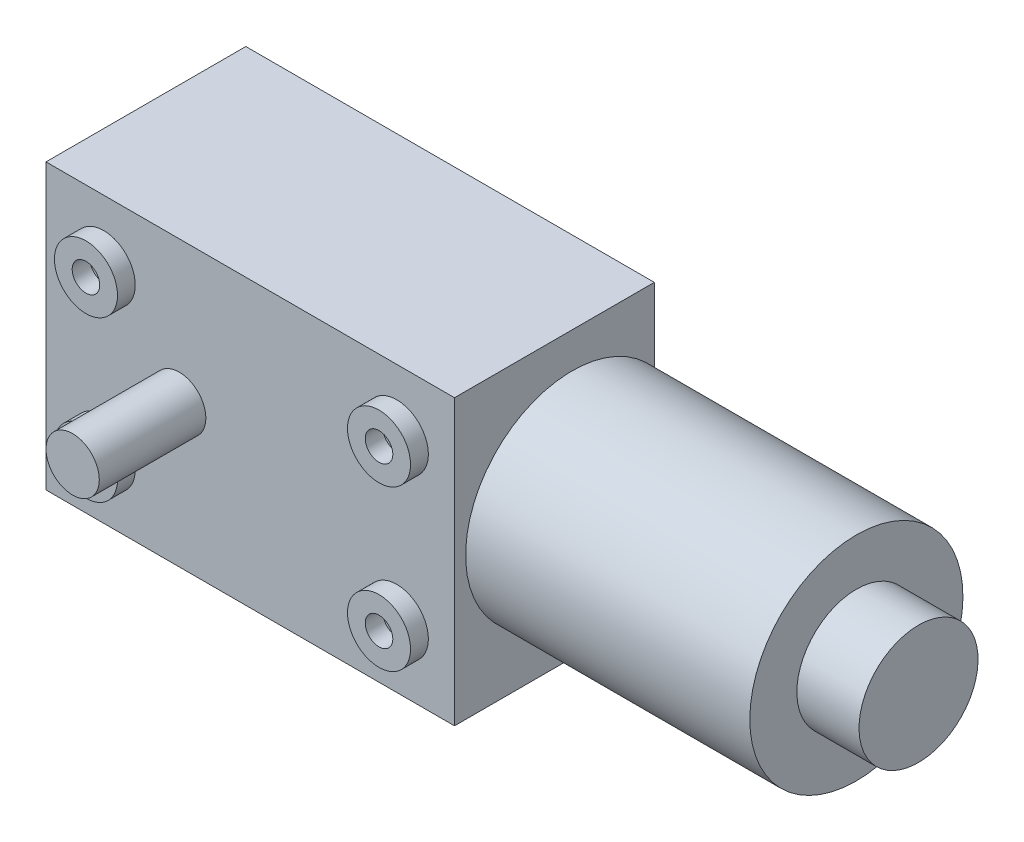
ISO-10303-21;
HEADER;
FILE_DESCRIPTION(('STEP AP214'),'2;1');
FILE_NAME('part.step','',(''),(''),'','','');
FILE_SCHEMA(('AUTOMOTIVE_DESIGN { 1 0 10303 214 1 1 1 1 }'));
ENDSEC;
DATA;
#1=APPLICATION_CONTEXT('core data for automotive mechanical design processes');
#2=APPLICATION_PROTOCOL_DEFINITION('international standard','automotive_design',2000,#1);
#3=PRODUCT_CONTEXT('',#1,'mechanical');
#4=PRODUCT('Part','Part','',(#3));
#5=PRODUCT_RELATED_PRODUCT_CATEGORY('part','',(#4));
#6=PRODUCT_DEFINITION_FORMATION('','',#4);
#7=PRODUCT_DEFINITION_CONTEXT('part definition',#1,'design');
#8=PRODUCT_DEFINITION('design','',#6,#7);
#9=PRODUCT_DEFINITION_SHAPE('','',#8);
#10=(LENGTH_UNIT() NAMED_UNIT(*) SI_UNIT(.MILLI.,.METRE.));
#11=(NAMED_UNIT(*) PLANE_ANGLE_UNIT() SI_UNIT($,.RADIAN.));
#12=(NAMED_UNIT(*) SI_UNIT($,.STERADIAN.) SOLID_ANGLE_UNIT());
#13=UNCERTAINTY_MEASURE_WITH_UNIT(LENGTH_MEASURE(1.E-05),#10,'distance_accuracy_value','');
#14=(GEOMETRIC_REPRESENTATION_CONTEXT(3) GLOBAL_UNCERTAINTY_ASSIGNED_CONTEXT((#13)) GLOBAL_UNIT_ASSIGNED_CONTEXT((#10,
#11,#12)) REPRESENTATION_CONTEXT('',''));
#15=CARTESIAN_POINT('',(0.,0.,0.));
#16=DIRECTION('',(0.,0.,1.));
#17=DIRECTION('',(1.,0.,0.));
#18=AXIS2_PLACEMENT_3D('',#15,#16,#17);
#19=CARTESIAN_POINT('',(-23.,16.,22.5));
#20=DIRECTION('',(1.,0.,0.));
#21=DIRECTION('',(0.,1.,0.));
#22=AXIS2_PLACEMENT_3D('',#19,#20,#21);
#23=PLANE('',#22);
#24=DIRECTION('',(0.,-1.,0.));
#25=VECTOR('',#24,1.);
#26=CARTESIAN_POINT('',(-23.,16.,0.));
#27=LINE('',#26,#25);
#28=CARTESIAN_POINT('',(-23.,16.,0.));
#29=VERTEX_POINT('',#28);
#30=CARTESIAN_POINT('',(-23.,-16.,0.));
#31=VERTEX_POINT('',#30);
#32=EDGE_CURVE('E157',#29,#31,#27,.T.);
#33=ORIENTED_EDGE('',*,*,#32,.T.);
#34=DIRECTION('',(0.,0.,-1.));
#35=VECTOR('',#34,1.);
#36=CARTESIAN_POINT('',(-23.,-16.,22.5));
#37=LINE('',#36,#35);
#38=CARTESIAN_POINT('',(-23.,-16.,22.5));
#39=VERTEX_POINT('',#38);
#40=EDGE_CURVE('E176',#39,#31,#37,.T.);
#41=ORIENTED_EDGE('',*,*,#40,.F.);
#42=DIRECTION('',(0.,-1.,0.));
#43=VECTOR('',#42,1.);
#44=CARTESIAN_POINT('',(-23.,16.,22.5));
#45=LINE('',#44,#43);
#46=CARTESIAN_POINT('',(-23.,16.,22.5));
#47=VERTEX_POINT('',#46);
#48=EDGE_CURVE('E160',#47,#39,#45,.T.);
#49=ORIENTED_EDGE('',*,*,#48,.F.);
#50=DIRECTION('',(0.,0.,-1.));
#51=VECTOR('',#50,1.);
#52=CARTESIAN_POINT('',(-23.,16.,22.5));
#53=LINE('',#52,#51);
#54=EDGE_CURVE('E166',#47,#29,#53,.T.);
#55=ORIENTED_EDGE('',*,*,#54,.T.);
#56=EDGE_LOOP('',(#33,#41,#49,#55));
#57=FACE_BOUND('',#56,.T.);
#58=ADVANCED_FACE('F34',(#57),#23,.F.);
#59=CARTESIAN_POINT('',(-23.,-16.,22.5));
#60=DIRECTION('',(0.,1.,0.));
#61=DIRECTION('',(0.,0.,1.));
#62=AXIS2_PLACEMENT_3D('',#59,#60,#61);
#63=PLANE('',#62);
#64=DIRECTION('',(1.,0.,0.));
#65=VECTOR('',#64,1.);
#66=CARTESIAN_POINT('',(-23.,-16.,0.));
#67=LINE('',#66,#65);
#68=CARTESIAN_POINT('',(23.,-16.,0.));
#69=VERTEX_POINT('',#68);
#70=EDGE_CURVE('E169',#31,#69,#67,.T.);
#71=ORIENTED_EDGE('',*,*,#70,.T.);
#72=DIRECTION('',(0.,0.,-1.));
#73=VECTOR('',#72,1.);
#74=CARTESIAN_POINT('',(23.,-16.,22.5));
#75=LINE('',#74,#73);
#76=CARTESIAN_POINT('',(23.,-16.,22.5));
#77=VERTEX_POINT('',#76);
#78=EDGE_CURVE('E94',#77,#69,#75,.T.);
#79=ORIENTED_EDGE('',*,*,#78,.F.);
#80=DIRECTION('',(1.,0.,0.));
#81=VECTOR('',#80,1.);
#82=CARTESIAN_POINT('',(-23.,-16.,22.5));
#83=LINE('',#82,#81);
#84=EDGE_CURVE('E86',#39,#77,#83,.T.);
#85=ORIENTED_EDGE('',*,*,#84,.F.);
#86=ORIENTED_EDGE('',*,*,#40,.T.);
#87=EDGE_LOOP('',(#71,#79,#85,#86));
#88=FACE_BOUND('',#87,.T.);
#89=ADVANCED_FACE('F217',(#88),#63,.F.);
#90=CARTESIAN_POINT('',(23.,16.,22.5));
#91=DIRECTION('',(-1.,0.,0.));
#92=DIRECTION('',(0.,-1.,0.));
#93=AXIS2_PLACEMENT_3D('',#90,#91,#92);
#94=PLANE('',#93);
#95=CARTESIAN_POINT('',(23.,0.,9.25));
#96=DIRECTION('',(1.,0.,0.));
#97=DIRECTION('',(0.,1.,0.));
#98=AXIS2_PLACEMENT_3D('',#95,#96,#97);
#99=CIRCLE('',#98,12.);
#100=CARTESIAN_POINT('',(23.,7.64444242571034,0.));
#101=VERTEX_POINT('',#100);
#102=CARTESIAN_POINT('',(23.,-7.64444242571033,0.));
#103=VERTEX_POINT('',#102);
#104=EDGE_CURVE('E42',#101,#103,#99,.T.);
#105=ORIENTED_EDGE('',*,*,#104,.F.);
#106=DIRECTION('',(0.,1.,0.));
#107=VECTOR('',#106,1.);
#108=CARTESIAN_POINT('',(23.,16.,0.));
#109=LINE('',#108,#107);
#110=CARTESIAN_POINT('',(23.,16.,0.));
#111=VERTEX_POINT('',#110);
#112=EDGE_CURVE('E98',#101,#111,#109,.T.);
#113=ORIENTED_EDGE('',*,*,#112,.T.);
#114=DIRECTION('',(0.,0.,-1.));
#115=VECTOR('',#114,1.);
#116=CARTESIAN_POINT('',(23.,16.,22.5));
#117=LINE('',#116,#115);
#118=CARTESIAN_POINT('',(23.,16.,22.5));
#119=VERTEX_POINT('',#118);
#120=EDGE_CURVE('E173',#119,#111,#117,.T.);
#121=ORIENTED_EDGE('',*,*,#120,.F.);
#122=DIRECTION('',(0.,1.,0.));
#123=VECTOR('',#122,1.);
#124=CARTESIAN_POINT('',(23.,16.,22.5));
#125=LINE('',#124,#123);
#126=EDGE_CURVE('E163',#77,#119,#125,.T.);
#127=ORIENTED_EDGE('',*,*,#126,.F.);
#128=ORIENTED_EDGE('',*,*,#78,.T.);
#129=EDGE_CURVE('E90',#69,#103,#109,.T.);
#130=ORIENTED_EDGE('',*,*,#129,.T.);
#131=EDGE_LOOP('',(#105,#113,#121,#127,#128,#130));
#132=FACE_BOUND('',#131,.T.);
#133=ADVANCED_FACE('F92',(#132),#94,.F.);
#134=CARTESIAN_POINT('',(-23.,16.,22.5));
#135=DIRECTION('',(0.,-1.,0.));
#136=DIRECTION('',(0.,0.,-1.));
#137=AXIS2_PLACEMENT_3D('',#134,#135,#136);
#138=PLANE('',#137);
#139=DIRECTION('',(-1.,0.,0.));
#140=VECTOR('',#139,1.);
#141=CARTESIAN_POINT('',(-23.,16.,0.));
#142=LINE('',#141,#140);
#143=EDGE_CURVE('E78',#111,#29,#142,.T.);
#144=ORIENTED_EDGE('',*,*,#143,.T.);
#145=ORIENTED_EDGE('',*,*,#54,.F.);
#146=DIRECTION('',(-1.,0.,0.));
#147=VECTOR('',#146,1.);
#148=CARTESIAN_POINT('',(-23.,16.,22.5));
#149=LINE('',#148,#147);
#150=EDGE_CURVE('E58',#119,#47,#149,.T.);
#151=ORIENTED_EDGE('',*,*,#150,.F.);
#152=ORIENTED_EDGE('',*,*,#120,.T.);
#153=EDGE_LOOP('',(#144,#145,#151,#152));
#154=FACE_BOUND('',#153,.T.);
#155=ADVANCED_FACE('F213',(#154),#138,.F.);
#156=CARTESIAN_POINT('',(0.,0.,22.5));
#157=DIRECTION('',(0.,0.,1.));
#158=DIRECTION('',(1.,0.,0.));
#159=AXIS2_PLACEMENT_3D('',#156,#157,#158);
#160=PLANE('',#159);
#161=CARTESIAN_POINT('',(16.5,8.99999999999999,22.5));
#162=DIRECTION('',(0.,0.,1.));
#163=DIRECTION('',(-1.,0.,0.));
#164=AXIS2_PLACEMENT_3D('',#161,#162,#163);
#165=CIRCLE('',#164,3.55);
#166=CARTESIAN_POINT('',(12.95,8.99999999999999,22.5));
#167=VERTEX_POINT('',#166);
#168=EDGE_CURVE('E120',#167,#167,#165,.T.);
#169=ORIENTED_EDGE('',*,*,#168,.F.);
#170=EDGE_LOOP('',(#169));
#171=FACE_BOUND('',#170,.T.);
#172=CARTESIAN_POINT('',(16.5,-9.00000000000001,22.5));
#173=DIRECTION('',(0.,0.,1.));
#174=DIRECTION('',(-1.,0.,0.));
#175=AXIS2_PLACEMENT_3D('',#172,#173,#174);
#176=CIRCLE('',#175,3.55);
#177=CARTESIAN_POINT('',(12.95,-9.00000000000001,22.5));
#178=VERTEX_POINT('',#177);
#179=EDGE_CURVE('E129',#178,#178,#176,.T.);
#180=ORIENTED_EDGE('',*,*,#179,.F.);
#181=EDGE_LOOP('',(#180));
#182=FACE_BOUND('',#181,.T.);
#183=CARTESIAN_POINT('',(-16.5,-9.,22.5));
#184=DIRECTION('',(0.,0.,1.));
#185=DIRECTION('',(1.,0.,0.));
#186=AXIS2_PLACEMENT_3D('',#183,#184,#185);
#187=CIRCLE('',#186,3.55);
#188=CARTESIAN_POINT('',(-12.95,-9.,22.5));
#189=VERTEX_POINT('',#188);
#190=EDGE_CURVE('E138',#189,#189,#187,.T.);
#191=ORIENTED_EDGE('',*,*,#190,.F.);
#192=EDGE_LOOP('',(#191));
#193=FACE_BOUND('',#192,.T.);
#194=CARTESIAN_POINT('',(-16.5,9.,22.5));
#195=DIRECTION('',(0.,0.,1.));
#196=DIRECTION('',(1.,0.,0.));
#197=AXIS2_PLACEMENT_3D('',#194,#195,#196);
#198=CIRCLE('',#197,3.55);
#199=CARTESIAN_POINT('',(-12.95,9.,22.5));
#200=VERTEX_POINT('',#199);
#201=EDGE_CURVE('E147',#200,#200,#198,.T.);
#202=ORIENTED_EDGE('',*,*,#201,.F.);
#203=EDGE_LOOP('',(#202));
#204=FACE_BOUND('',#203,.T.);
#205=CARTESIAN_POINT('',(-8.,0.,22.5));
#206=DIRECTION('',(0.,0.,1.));
#207=DIRECTION('',(1.,0.,0.));
#208=AXIS2_PLACEMENT_3D('',#205,#206,#207);
#209=CIRCLE('',#208,3.);
#210=CARTESIAN_POINT('',(-5.,0.,22.5));
#211=VERTEX_POINT('',#210);
#212=EDGE_CURVE('E151',#211,#211,#209,.T.);
#213=ORIENTED_EDGE('',*,*,#212,.F.);
#214=EDGE_LOOP('',(#213));
#215=FACE_BOUND('',#214,.T.);
#216=ORIENTED_EDGE('',*,*,#48,.T.);
#217=ORIENTED_EDGE('',*,*,#84,.T.);
#218=ORIENTED_EDGE('',*,*,#126,.T.);
#219=ORIENTED_EDGE('',*,*,#150,.T.);
#220=EDGE_LOOP('',(#216,#217,#218,#219));
#221=FACE_BOUND('',#220,.T.);
#222=ADVANCED_FACE('F196',(#171,#182,#193,#204,#215,#221),#160,.T.);
#223=CARTESIAN_POINT('',(0.,0.,0.));
#224=DIRECTION('',(0.,0.,1.));
#225=DIRECTION('',(1.,0.,0.));
#226=AXIS2_PLACEMENT_3D('',#223,#224,#225);
#227=PLANE('',#226);
#228=ORIENTED_EDGE('',*,*,#32,.F.);
#229=ORIENTED_EDGE('',*,*,#143,.F.);
#230=ORIENTED_EDGE('',*,*,#112,.F.);
#231=EDGE_CURVE('E96',#103,#101,#109,.T.);
#232=ORIENTED_EDGE('',*,*,#231,.F.);
#233=ORIENTED_EDGE('',*,*,#129,.F.);
#234=ORIENTED_EDGE('',*,*,#70,.F.);
#235=EDGE_LOOP('',(#228,#229,#230,#232,#233,#234));
#236=FACE_BOUND('',#235,.T.);
#237=ADVANCED_FACE('F101',(#236),#227,.F.);
#238=CARTESIAN_POINT('',(-8.,0.,34.5));
#239=DIRECTION('',(0.,0.,-1.));
#240=DIRECTION('',(-1.,0.,0.));
#241=AXIS2_PLACEMENT_3D('',#238,#239,#240);
#242=CYLINDRICAL_SURFACE('',#241,3.);
#243=CARTESIAN_POINT('',(-8.,0.,34.5));
#244=DIRECTION('',(0.,0.,1.));
#245=DIRECTION('',(1.,0.,0.));
#246=AXIS2_PLACEMENT_3D('',#243,#244,#245);
#247=CIRCLE('',#246,3.);
#248=CARTESIAN_POINT('',(-5.,0.,34.5));
#249=VERTEX_POINT('',#248);
#250=EDGE_CURVE('E154',#249,#249,#247,.T.);
#251=ORIENTED_EDGE('',*,*,#250,.F.);
#252=EDGE_LOOP('',(#251));
#253=FACE_BOUND('',#252,.T.);
#254=ORIENTED_EDGE('',*,*,#212,.T.);
#255=EDGE_LOOP('',(#254));
#256=FACE_BOUND('',#255,.T.);
#257=ADVANCED_FACE('F232',(#253,#256),#242,.T.);
#258=CARTESIAN_POINT('',(-8.,0.,34.5));
#259=DIRECTION('',(0.,0.,1.));
#260=DIRECTION('',(1.,0.,0.));
#261=AXIS2_PLACEMENT_3D('',#258,#259,#260);
#262=PLANE('',#261);
#263=ORIENTED_EDGE('',*,*,#250,.T.);
#264=EDGE_LOOP('',(#263));
#265=FACE_BOUND('',#264,.T.);
#266=ADVANCED_FACE('F236',(#265),#262,.T.);
#267=CARTESIAN_POINT('',(-16.5,9.,24.5));
#268=DIRECTION('',(0.,0.,1.));
#269=DIRECTION('',(1.,0.,0.));
#270=AXIS2_PLACEMENT_3D('',#267,#268,#269);
#271=PLANE('',#270);
#272=CARTESIAN_POINT('',(-16.5,9.,24.5));
#273=DIRECTION('',(0.,0.,1.));
#274=DIRECTION('',(1.,0.,0.));
#275=AXIS2_PLACEMENT_3D('',#272,#273,#274);
#276=CIRCLE('',#275,3.55);
#277=CARTESIAN_POINT('',(-12.95,9.,24.5));
#278=VERTEX_POINT('',#277);
#279=EDGE_CURVE('E148',#278,#278,#276,.T.);
#280=ORIENTED_EDGE('',*,*,#279,.T.);
#281=EDGE_LOOP('',(#280));
#282=FACE_BOUND('',#281,.T.);
#283=CARTESIAN_POINT('',(-16.5,9.,24.5));
#284=DIRECTION('',(0.,0.,1.));
#285=DIRECTION('',(1.,0.,0.));
#286=AXIS2_PLACEMENT_3D('',#283,#284,#285);
#287=CIRCLE('',#286,1.55);
#288=CARTESIAN_POINT('',(-14.95,9.,24.5));
#289=VERTEX_POINT('',#288);
#290=EDGE_CURVE('E142',#289,#289,#287,.T.);
#291=ORIENTED_EDGE('',*,*,#290,.F.);
#292=EDGE_LOOP('',(#291));
#293=FACE_BOUND('',#292,.T.);
#294=ADVANCED_FACE('F241',(#282,#293),#271,.T.);
#295=CARTESIAN_POINT('',(-16.5,9.,24.5));
#296=DIRECTION('',(0.,0.,-1.));
#297=DIRECTION('',(-1.,0.,0.));
#298=AXIS2_PLACEMENT_3D('',#295,#296,#297);
#299=CYLINDRICAL_SURFACE('',#298,3.55);
#300=ORIENTED_EDGE('',*,*,#279,.F.);
#301=EDGE_LOOP('',(#300));
#302=FACE_BOUND('',#301,.T.);
#303=ORIENTED_EDGE('',*,*,#201,.T.);
#304=EDGE_LOOP('',(#303));
#305=FACE_BOUND('',#304,.T.);
#306=ADVANCED_FACE('F247',(#302,#305),#299,.T.);
#307=CARTESIAN_POINT('',(-16.5,9.,24.5));
#308=DIRECTION('',(0.,0.,-1.));
#309=DIRECTION('',(-1.,0.,0.));
#310=AXIS2_PLACEMENT_3D('',#307,#308,#309);
#311=CYLINDRICAL_SURFACE('',#310,1.55);
#312=ORIENTED_EDGE('',*,*,#290,.T.);
#313=EDGE_LOOP('',(#312));
#314=FACE_BOUND('',#313,.T.);
#315=CARTESIAN_POINT('',(-16.5,9.,22.5));
#316=DIRECTION('',(0.,0.,1.));
#317=DIRECTION('',(1.,0.,0.));
#318=AXIS2_PLACEMENT_3D('',#315,#316,#317);
#319=CIRCLE('',#318,1.55);
#320=CARTESIAN_POINT('',(-14.95,9.,22.5));
#321=VERTEX_POINT('',#320);
#322=EDGE_CURVE('E178',#321,#321,#319,.F.);
#323=ORIENTED_EDGE('',*,*,#322,.T.);
#324=EDGE_LOOP('',(#323));
#325=FACE_BOUND('',#324,.T.);
#326=ADVANCED_FACE('F250',(#314,#325),#311,.F.);
#327=ORIENTED_EDGE('',*,*,#322,.F.);
#328=EDGE_LOOP('',(#327));
#329=FACE_BOUND('',#328,.T.);
#330=ADVANCED_FACE('F215',(#329),#160,.T.);
#331=CARTESIAN_POINT('',(-16.5,-9.,24.5));
#332=DIRECTION('',(0.,0.,1.));
#333=DIRECTION('',(1.,0.,0.));
#334=AXIS2_PLACEMENT_3D('',#331,#332,#333);
#335=PLANE('',#334);
#336=CARTESIAN_POINT('',(-16.5,-9.,24.5));
#337=DIRECTION('',(0.,0.,1.));
#338=DIRECTION('',(1.,0.,0.));
#339=AXIS2_PLACEMENT_3D('',#336,#337,#338);
#340=CIRCLE('',#339,3.55);
#341=CARTESIAN_POINT('',(-12.95,-9.,24.5));
#342=VERTEX_POINT('',#341);
#343=EDGE_CURVE('E139',#342,#342,#340,.T.);
#344=ORIENTED_EDGE('',*,*,#343,.T.);
#345=EDGE_LOOP('',(#344));
#346=FACE_BOUND('',#345,.T.);
#347=CARTESIAN_POINT('',(-16.5,-9.,24.5));
#348=DIRECTION('',(0.,0.,1.));
#349=DIRECTION('',(1.,0.,0.));
#350=AXIS2_PLACEMENT_3D('',#347,#348,#349);
#351=CIRCLE('',#350,1.55);
#352=CARTESIAN_POINT('',(-14.95,-9.,24.5));
#353=VERTEX_POINT('',#352);
#354=EDGE_CURVE('E133',#353,#353,#351,.T.);
#355=ORIENTED_EDGE('',*,*,#354,.F.);
#356=EDGE_LOOP('',(#355));
#357=FACE_BOUND('',#356,.T.);
#358=ADVANCED_FACE('F262',(#346,#357),#335,.T.);
#359=CARTESIAN_POINT('',(-16.5,-9.,24.5));
#360=DIRECTION('',(0.,0.,-1.));
#361=DIRECTION('',(-1.,0.,0.));
#362=AXIS2_PLACEMENT_3D('',#359,#360,#361);
#363=CYLINDRICAL_SURFACE('',#362,3.55);
#364=ORIENTED_EDGE('',*,*,#343,.F.);
#365=EDGE_LOOP('',(#364));
#366=FACE_BOUND('',#365,.T.);
#367=ORIENTED_EDGE('',*,*,#190,.T.);
#368=EDGE_LOOP('',(#367));
#369=FACE_BOUND('',#368,.T.);
#370=ADVANCED_FACE('F258',(#366,#369),#363,.T.);
#371=CARTESIAN_POINT('',(-16.5,-9.,24.5));
#372=DIRECTION('',(0.,0.,-1.));
#373=DIRECTION('',(-1.,0.,0.));
#374=AXIS2_PLACEMENT_3D('',#371,#372,#373);
#375=CYLINDRICAL_SURFACE('',#374,1.55);
#376=ORIENTED_EDGE('',*,*,#354,.T.);
#377=EDGE_LOOP('',(#376));
#378=FACE_BOUND('',#377,.T.);
#379=CARTESIAN_POINT('',(-16.5,-9.,22.5));
#380=DIRECTION('',(0.,0.,1.));
#381=DIRECTION('',(1.,0.,0.));
#382=AXIS2_PLACEMENT_3D('',#379,#380,#381);
#383=CIRCLE('',#382,1.55);
#384=CARTESIAN_POINT('',(-14.95,-9.,22.5));
#385=VERTEX_POINT('',#384);
#386=EDGE_CURVE('E181',#385,#385,#383,.F.);
#387=ORIENTED_EDGE('',*,*,#386,.T.);
#388=EDGE_LOOP('',(#387));
#389=FACE_BOUND('',#388,.T.);
#390=ADVANCED_FACE('F261',(#378,#389),#375,.F.);
#391=ORIENTED_EDGE('',*,*,#386,.F.);
#392=EDGE_LOOP('',(#391));
#393=FACE_BOUND('',#392,.T.);
#394=ADVANCED_FACE('F211',(#393),#160,.T.);
#395=CARTESIAN_POINT('',(16.5,-9.00000000000001,24.5));
#396=DIRECTION('',(0.,0.,-1.));
#397=DIRECTION('',(-1.,0.,0.));
#398=AXIS2_PLACEMENT_3D('',#395,#396,#397);
#399=PLANE('',#398);
#400=CARTESIAN_POINT('',(16.5,-9.00000000000001,24.5));
#401=DIRECTION('',(0.,0.,1.));
#402=DIRECTION('',(-1.,0.,0.));
#403=AXIS2_PLACEMENT_3D('',#400,#401,#402);
#404=CIRCLE('',#403,3.55);
#405=CARTESIAN_POINT('',(12.95,-9.00000000000001,24.5));
#406=VERTEX_POINT('',#405);
#407=EDGE_CURVE('E130',#406,#406,#404,.T.);
#408=ORIENTED_EDGE('',*,*,#407,.T.);
#409=EDGE_LOOP('',(#408));
#410=FACE_BOUND('',#409,.T.);
#411=CARTESIAN_POINT('',(16.5,-9.00000000000001,24.5));
#412=DIRECTION('',(0.,0.,1.));
#413=DIRECTION('',(-1.,0.,0.));
#414=AXIS2_PLACEMENT_3D('',#411,#412,#413);
#415=CIRCLE('',#414,1.55);
#416=CARTESIAN_POINT('',(14.95,-9.00000000000001,24.5));
#417=VERTEX_POINT('',#416);
#418=EDGE_CURVE('E124',#417,#417,#415,.T.);
#419=ORIENTED_EDGE('',*,*,#418,.F.);
#420=EDGE_LOOP('',(#419));
#421=FACE_BOUND('',#420,.T.);
#422=ADVANCED_FACE('F273',(#410,#421),#399,.F.);
#423=CARTESIAN_POINT('',(16.5,-9.00000000000001,24.5));
#424=DIRECTION('',(0.,0.,-1.));
#425=DIRECTION('',(-1.,0.,0.));
#426=AXIS2_PLACEMENT_3D('',#423,#424,#425);
#427=CYLINDRICAL_SURFACE('',#426,3.55);
#428=ORIENTED_EDGE('',*,*,#407,.F.);
#429=EDGE_LOOP('',(#428));
#430=FACE_BOUND('',#429,.T.);
#431=ORIENTED_EDGE('',*,*,#179,.T.);
#432=EDGE_LOOP('',(#431));
#433=FACE_BOUND('',#432,.T.);
#434=ADVANCED_FACE('F270',(#430,#433),#427,.T.);
#435=CARTESIAN_POINT('',(16.5,-9.00000000000001,24.5));
#436=DIRECTION('',(0.,0.,-1.));
#437=DIRECTION('',(-1.,0.,0.));
#438=AXIS2_PLACEMENT_3D('',#435,#436,#437);
#439=CYLINDRICAL_SURFACE('',#438,1.55);
#440=ORIENTED_EDGE('',*,*,#418,.T.);
#441=EDGE_LOOP('',(#440));
#442=FACE_BOUND('',#441,.T.);
#443=CARTESIAN_POINT('',(16.5,-9.00000000000001,22.5));
#444=DIRECTION('',(0.,0.,1.));
#445=DIRECTION('',(1.,0.,0.));
#446=AXIS2_PLACEMENT_3D('',#443,#444,#445);
#447=CIRCLE('',#446,1.55);
#448=CARTESIAN_POINT('',(18.05,-9.00000000000001,22.5));
#449=VERTEX_POINT('',#448);
#450=EDGE_CURVE('E183',#449,#449,#447,.F.);
#451=ORIENTED_EDGE('',*,*,#450,.T.);
#452=EDGE_LOOP('',(#451));
#453=FACE_BOUND('',#452,.T.);
#454=ADVANCED_FACE('F209',(#442,#453),#439,.F.);
#455=ORIENTED_EDGE('',*,*,#450,.F.);
#456=EDGE_LOOP('',(#455));
#457=FACE_BOUND('',#456,.T.);
#458=ADVANCED_FACE('F195',(#457),#160,.T.);
#459=CARTESIAN_POINT('',(16.5,8.99999999999999,24.5));
#460=DIRECTION('',(0.,0.,-1.));
#461=DIRECTION('',(-1.,0.,0.));
#462=AXIS2_PLACEMENT_3D('',#459,#460,#461);
#463=PLANE('',#462);
#464=CARTESIAN_POINT('',(16.5,8.99999999999999,24.5));
#465=DIRECTION('',(0.,0.,1.));
#466=DIRECTION('',(-1.,0.,0.));
#467=AXIS2_PLACEMENT_3D('',#464,#465,#466);
#468=CIRCLE('',#467,3.55);
#469=CARTESIAN_POINT('',(12.95,8.99999999999999,24.5));
#470=VERTEX_POINT('',#469);
#471=EDGE_CURVE('E121',#470,#470,#468,.T.);
#472=ORIENTED_EDGE('',*,*,#471,.T.);
#473=EDGE_LOOP('',(#472));
#474=FACE_BOUND('',#473,.T.);
#475=CARTESIAN_POINT('',(16.5,8.99999999999999,24.5));
#476=DIRECTION('',(0.,0.,1.));
#477=DIRECTION('',(-1.,0.,0.));
#478=AXIS2_PLACEMENT_3D('',#475,#476,#477);
#479=CIRCLE('',#478,1.55);
#480=CARTESIAN_POINT('',(14.95,8.99999999999999,24.5));
#481=VERTEX_POINT('',#480);
#482=EDGE_CURVE('E113',#481,#481,#479,.T.);
#483=ORIENTED_EDGE('',*,*,#482,.F.);
#484=EDGE_LOOP('',(#483));
#485=FACE_BOUND('',#484,.T.);
#486=ADVANCED_FACE('F208',(#474,#485),#463,.F.);
#487=CARTESIAN_POINT('',(16.5,8.99999999999999,24.5));
#488=DIRECTION('',(0.,0.,-1.));
#489=DIRECTION('',(-1.,0.,0.));
#490=AXIS2_PLACEMENT_3D('',#487,#488,#489);
#491=CYLINDRICAL_SURFACE('',#490,3.55);
#492=ORIENTED_EDGE('',*,*,#471,.F.);
#493=EDGE_LOOP('',(#492));
#494=FACE_BOUND('',#493,.T.);
#495=ORIENTED_EDGE('',*,*,#168,.T.);
#496=EDGE_LOOP('',(#495));
#497=FACE_BOUND('',#496,.T.);
#498=ADVANCED_FACE('F202',(#494,#497),#491,.T.);
#499=CARTESIAN_POINT('',(16.5,8.99999999999999,24.5));
#500=DIRECTION('',(0.,0.,-1.));
#501=DIRECTION('',(-1.,0.,0.));
#502=AXIS2_PLACEMENT_3D('',#499,#500,#501);
#503=CYLINDRICAL_SURFACE('',#502,1.55);
#504=ORIENTED_EDGE('',*,*,#482,.T.);
#505=EDGE_LOOP('',(#504));
#506=FACE_BOUND('',#505,.T.);
#507=CARTESIAN_POINT('',(16.5,8.99999999999999,22.5));
#508=DIRECTION('',(0.,0.,1.));
#509=DIRECTION('',(1.,0.,0.));
#510=AXIS2_PLACEMENT_3D('',#507,#508,#509);
#511=CIRCLE('',#510,1.55);
#512=CARTESIAN_POINT('',(18.05,8.99999999999999,22.5));
#513=VERTEX_POINT('',#512);
#514=EDGE_CURVE('E37',#513,#513,#511,.F.);
#515=ORIENTED_EDGE('',*,*,#514,.T.);
#516=EDGE_LOOP('',(#515));
#517=FACE_BOUND('',#516,.T.);
#518=ADVANCED_FACE('F190',(#506,#517),#503,.F.);
#519=ORIENTED_EDGE('',*,*,#514,.F.);
#520=EDGE_LOOP('',(#519));
#521=FACE_BOUND('',#520,.T.);
#522=ADVANCED_FACE('F192',(#521),#160,.T.);
#523=CARTESIAN_POINT('',(23.,0.,9.25));
#524=DIRECTION('',(1.,0.,0.));
#525=DIRECTION('',(0.,1.,0.));
#526=AXIS2_PLACEMENT_3D('',#523,#524,#525);
#527=PLANE('',#526);
#528=EDGE_CURVE('E107',#103,#101,#99,.T.);
#529=ORIENTED_EDGE('',*,*,#528,.F.);
#530=ORIENTED_EDGE('',*,*,#231,.T.);
#531=EDGE_LOOP('',(#529,#530));
#532=FACE_BOUND('',#531,.T.);
#533=ADVANCED_FACE('F109',(#532),#527,.F.);
#534=CARTESIAN_POINT('',(55.,0.,9.25));
#535=DIRECTION('',(-1.,0.,0.));
#536=DIRECTION('',(0.,-1.,0.));
#537=AXIS2_PLACEMENT_3D('',#534,#535,#536);
#538=CYLINDRICAL_SURFACE('',#537,12.);
#539=CARTESIAN_POINT('',(55.,0.,9.25));
#540=DIRECTION('',(1.,0.,0.));
#541=DIRECTION('',(0.,1.,0.));
#542=AXIS2_PLACEMENT_3D('',#539,#540,#541);
#543=CIRCLE('',#542,12.);
#544=CARTESIAN_POINT('',(55.,12.,9.25));
#545=VERTEX_POINT('',#544);
#546=EDGE_CURVE('E110',#545,#545,#543,.T.);
#547=ORIENTED_EDGE('',*,*,#546,.F.);
#548=EDGE_LOOP('',(#547));
#549=FACE_BOUND('',#548,.T.);
#550=ORIENTED_EDGE('',*,*,#528,.T.);
#551=ORIENTED_EDGE('',*,*,#104,.T.);
#552=EDGE_LOOP('',(#550,#551));
#553=FACE_BOUND('',#552,.T.);
#554=ADVANCED_FACE('F106',(#549,#553),#538,.T.);
#555=CARTESIAN_POINT('',(55.,0.,9.25));
#556=DIRECTION('',(1.,0.,0.));
#557=DIRECTION('',(0.,1.,0.));
#558=AXIS2_PLACEMENT_3D('',#555,#556,#557);
#559=PLANE('',#558);
#560=CARTESIAN_POINT('',(55.,0.,9.25));
#561=DIRECTION('',(1.,0.,0.));
#562=DIRECTION('',(0.,1.,0.));
#563=AXIS2_PLACEMENT_3D('',#560,#561,#562);
#564=CIRCLE('',#563,6.7);
#565=CARTESIAN_POINT('',(55.,6.70000000000001,9.25));
#566=VERTEX_POINT('',#565);
#567=EDGE_CURVE('E11',#566,#566,#564,.T.);
#568=ORIENTED_EDGE('',*,*,#567,.F.);
#569=EDGE_LOOP('',(#568));
#570=FACE_BOUND('',#569,.T.);
#571=ORIENTED_EDGE('',*,*,#546,.T.);
#572=EDGE_LOOP('',(#571));
#573=FACE_BOUND('',#572,.T.);
#574=ADVANCED_FACE('F288',(#570,#573),#559,.T.);
#575=CARTESIAN_POINT('',(62.,0.,9.25));
#576=DIRECTION('',(-1.,0.,0.));
#577=DIRECTION('',(0.,-1.,0.));
#578=AXIS2_PLACEMENT_3D('',#575,#576,#577);
#579=CYLINDRICAL_SURFACE('',#578,6.7);
#580=CARTESIAN_POINT('',(62.,0.,9.25));
#581=DIRECTION('',(1.,0.,0.));
#582=DIRECTION('',(0.,1.,0.));
#583=AXIS2_PLACEMENT_3D('',#580,#581,#582);
#584=CIRCLE('',#583,6.7);
#585=CARTESIAN_POINT('',(62.,6.70000000000001,9.25));
#586=VERTEX_POINT('',#585);
#587=EDGE_CURVE('E111',#586,#586,#584,.T.);
#588=ORIENTED_EDGE('',*,*,#587,.F.);
#589=EDGE_LOOP('',(#588));
#590=FACE_BOUND('',#589,.T.);
#591=ORIENTED_EDGE('',*,*,#567,.T.);
#592=EDGE_LOOP('',(#591));
#593=FACE_BOUND('',#592,.T.);
#594=ADVANCED_FACE('F293',(#590,#593),#579,.T.);
#595=CARTESIAN_POINT('',(62.,0.,9.25));
#596=DIRECTION('',(1.,0.,0.));
#597=DIRECTION('',(0.,1.,0.));
#598=AXIS2_PLACEMENT_3D('',#595,#596,#597);
#599=PLANE('',#598);
#600=ORIENTED_EDGE('',*,*,#587,.T.);
#601=EDGE_LOOP('',(#600));
#602=FACE_BOUND('',#601,.T.);
#603=ADVANCED_FACE('F297',(#602),#599,.T.);
#604=CLOSED_SHELL('',(#58,#89,#133,#155,#222,#237,#257,#266,#294,#306,#326,#330,#358,#370,#390,
#394,#422,#434,#454,#458,#486,#498,#518,#522,#533,#554,#574,#594,#603));
#605=MANIFOLD_SOLID_BREP('B2',#604);
#606=ADVANCED_BREP_SHAPE_REPRESENTATION('',(#18,#605),#14);
#607=SHAPE_DEFINITION_REPRESENTATION(#9,#606);
ENDSEC;
END-ISO-10303-21;
